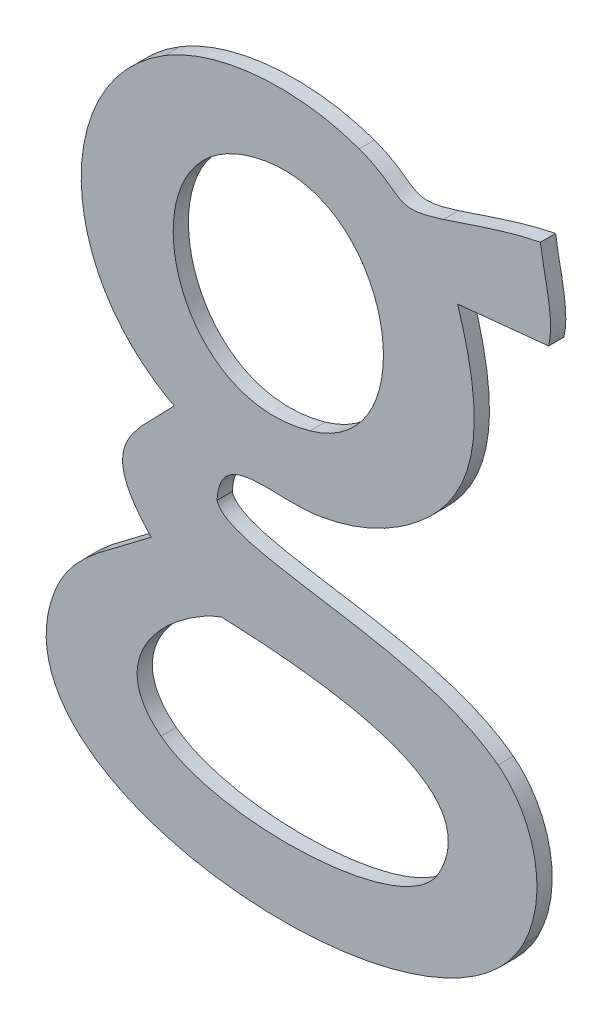
ISO-10303-21;
HEADER;
FILE_DESCRIPTION(('STEP AP214'),'2;1');
FILE_NAME('part.step','',(''),(''),'','','');
FILE_SCHEMA(('AUTOMOTIVE_DESIGN { 1 0 10303 214 1 1 1 1 }'));
ENDSEC;
DATA;
#1=APPLICATION_CONTEXT('core data for automotive mechanical design processes');
#2=APPLICATION_PROTOCOL_DEFINITION('international standard','automotive_design',2000,#1);
#3=PRODUCT_CONTEXT('',#1,'mechanical');
#4=PRODUCT('Part','Part','',(#3));
#5=PRODUCT_RELATED_PRODUCT_CATEGORY('part','',(#4));
#6=PRODUCT_DEFINITION_FORMATION('','',#4);
#7=PRODUCT_DEFINITION_CONTEXT('part definition',#1,'design');
#8=PRODUCT_DEFINITION('design','',#6,#7);
#9=PRODUCT_DEFINITION_SHAPE('','',#8);
#10=(LENGTH_UNIT() NAMED_UNIT(*) SI_UNIT(.MILLI.,.METRE.));
#11=(NAMED_UNIT(*) PLANE_ANGLE_UNIT() SI_UNIT($,.RADIAN.));
#12=(NAMED_UNIT(*) SI_UNIT($,.STERADIAN.) SOLID_ANGLE_UNIT());
#13=UNCERTAINTY_MEASURE_WITH_UNIT(LENGTH_MEASURE(1.E-05),#10,'distance_accuracy_value','');
#14=(GEOMETRIC_REPRESENTATION_CONTEXT(3) GLOBAL_UNCERTAINTY_ASSIGNED_CONTEXT((#13)) GLOBAL_UNIT_ASSIGNED_CONTEXT((#10,
#11,#12)) REPRESENTATION_CONTEXT('',''));
#15=CARTESIAN_POINT('',(0.,0.,0.));
#16=DIRECTION('',(0.,0.,1.));
#17=DIRECTION('',(1.,0.,0.));
#18=AXIS2_PLACEMENT_3D('',#15,#16,#17);
#19=CARTESIAN_POINT('',(-1.859483203125,-48.6271340234375,0.001));
#20=CARTESIAN_POINT('',(-1.859483203125,-48.6271340234375,0.));
#21=CARTESIAN_POINT('',(-1.8568278515625,-48.626718125,0.001));
#22=CARTESIAN_POINT('',(-1.8568278515625,-48.626718125,0.));
#23=CARTESIAN_POINT('',(-1.854620390625,-48.6255344140625,0.001));
#24=CARTESIAN_POINT('',(-1.854620390625,-48.6255344140625,0.));
#25=CARTESIAN_POINT('',(-1.8530527734375,-48.6242547265625,0.001));
#26=CARTESIAN_POINT('',(-1.8530527734375,-48.6242547265625,0.));
#27=B_SPLINE_SURFACE_WITH_KNOTS('',3,1,((#19,#20),(#21,#22),(#23,#24),(#25,#26)),.UNSPECIFIED.,
.F.,.F.,.F.,(4,4),(2,2),(0.75,0.8125),(0.,1.),.UNSPECIFIED.);
#28=CARTESIAN_POINT('',(-1.859483203125,-48.6271340234375,0.));
#29=CARTESIAN_POINT('',(-1.8568278515625,-48.626718125,0.));
#30=CARTESIAN_POINT('',(-1.854620390625,-48.6255344140625,0.));
#31=CARTESIAN_POINT('',(-1.8530527734375,-48.6242547265625,0.));
#32=B_SPLINE_CURVE_WITH_KNOTS('',3,(#28,#29,#30,#31),.UNSPECIFIED.,.F.,.F.,(4,4),(0.75,0.8125),.UNSPECIFIED.);
#33=CARTESIAN_POINT('',(-1.859483203125,-48.6271340234375,0.));
#34=VERTEX_POINT('',#33);
#35=CARTESIAN_POINT('',(-1.8530527734375,-48.6242547265625,0.));
#36=VERTEX_POINT('',#35);
#37=EDGE_CURVE('E11',#34,#36,#32,.T.);
#38=DIRECTION('',(0.,0.,-1.));
#39=VECTOR('',#38,1.);
#40=CARTESIAN_POINT('',(-1.8530527734375,-48.6242547265625,0.001));
#41=LINE('',#40,#39);
#42=CARTESIAN_POINT('',(-1.8530527734375,-48.6242547265625,0.001));
#43=VERTEX_POINT('',#42);
#44=EDGE_CURVE('E28',#43,#36,#41,.T.);
#45=CARTESIAN_POINT('',(-1.859483203125,-48.6271340234375,0.001));
#46=CARTESIAN_POINT('',(-1.8568278515625,-48.626718125,0.001));
#47=CARTESIAN_POINT('',(-1.854620390625,-48.6255344140625,0.001));
#48=CARTESIAN_POINT('',(-1.8530527734375,-48.6242547265625,0.001));
#49=B_SPLINE_CURVE_WITH_KNOTS('',3,(#45,#46,#47,#48),.UNSPECIFIED.,.F.,.F.,(4,4),(0.75,0.8125),.UNSPECIFIED.);
#50=CARTESIAN_POINT('',(-1.859483203125,-48.6271340234375,0.001));
#51=VERTEX_POINT('',#50);
#52=EDGE_CURVE('E464',#51,#43,#49,.T.);
#53=DIRECTION('',(0.,0.,-1.));
#54=VECTOR('',#53,1.);
#55=CARTESIAN_POINT('',(-1.859483203125,-48.6271340234375,0.001));
#56=LINE('',#55,#54);
#57=EDGE_CURVE('E40',#51,#34,#56,.T.);
#58=ORIENTED_EDGE('',*,*,#37,.T.);
#59=ORIENTED_EDGE('',*,*,#44,.F.);
#60=ORIENTED_EDGE('',*,*,#52,.F.);
#61=ORIENTED_EDGE('',*,*,#57,.T.);
#62=EDGE_LOOP('',(#58,#59,#60,#61));
#63=FACE_BOUND('',#62,.T.);
#64=ADVANCED_FACE('F17',(#63),#27,.F.);
#65=CARTESIAN_POINT('',(-1.8530527734375,-48.6242547265625,0.001));
#66=CARTESIAN_POINT('',(-1.8530527734375,-48.6242547265625,0.));
#67=CARTESIAN_POINT('',(-1.84892578125,-48.6209275390625,0.001));
#68=CARTESIAN_POINT('',(-1.84892578125,-48.6209275390625,0.));
#69=CARTESIAN_POINT('',(-1.848477890625,-48.6165126171875,0.001));
#70=CARTESIAN_POINT('',(-1.848477890625,-48.6165126171875,0.));
#71=CARTESIAN_POINT('',(-1.850397421875,-48.610530078125,0.001));
#72=CARTESIAN_POINT('',(-1.850397421875,-48.610530078125,0.));
#73=B_SPLINE_SURFACE_WITH_KNOTS('',3,1,((#65,#66),(#67,#68),(#69,#70),(#71,#72)),.UNSPECIFIED.,
.F.,.F.,.F.,(4,4),(2,2),(0.8125,0.875),(0.,1.),.UNSPECIFIED.);
#74=CARTESIAN_POINT('',(-1.8530527734375,-48.6242547265625,0.));
#75=CARTESIAN_POINT('',(-1.84892578125,-48.6209275390625,0.));
#76=CARTESIAN_POINT('',(-1.848477890625,-48.6165126171875,0.));
#77=CARTESIAN_POINT('',(-1.850397421875,-48.610530078125,0.));
#78=B_SPLINE_CURVE_WITH_KNOTS('',3,(#74,#75,#76,#77),.UNSPECIFIED.,.F.,.F.,(4,4),(0.8125,0.875),.UNSPECIFIED.);
#79=CARTESIAN_POINT('',(-1.850397421875,-48.610530078125,0.));
#80=VERTEX_POINT('',#79);
#81=EDGE_CURVE('E456',#36,#80,#78,.T.);
#82=DIRECTION('',(0.,0.,-1.));
#83=VECTOR('',#82,1.);
#84=CARTESIAN_POINT('',(-1.850397421875,-48.610530078125,0.001));
#85=LINE('',#84,#83);
#86=CARTESIAN_POINT('',(-1.850397421875,-48.610530078125,0.001));
#87=VERTEX_POINT('',#86);
#88=EDGE_CURVE('E451',#87,#80,#85,.T.);
#89=CARTESIAN_POINT('',(-1.8530527734375,-48.6242547265625,0.001));
#90=CARTESIAN_POINT('',(-1.84892578125,-48.6209275390625,0.001));
#91=CARTESIAN_POINT('',(-1.848477890625,-48.6165126171875,0.001));
#92=CARTESIAN_POINT('',(-1.850397421875,-48.610530078125,0.001));
#93=B_SPLINE_CURVE_WITH_KNOTS('',3,(#89,#90,#91,#92),.UNSPECIFIED.,.F.,.F.,(4,4),(0.8125,0.875),.UNSPECIFIED.);
#94=EDGE_CURVE('E447',#43,#87,#93,.T.);
#95=ORIENTED_EDGE('',*,*,#81,.T.);
#96=ORIENTED_EDGE('',*,*,#88,.F.);
#97=ORIENTED_EDGE('',*,*,#94,.F.);
#98=ORIENTED_EDGE('',*,*,#44,.T.);
#99=EDGE_LOOP('',(#95,#96,#97,#98));
#100=FACE_BOUND('',#99,.T.);
#101=ADVANCED_FACE('F475',(#100),#73,.F.);
#102=CARTESIAN_POINT('',(4.8696637390974,-47.9277431152291,0.001));
#103=DIRECTION('',(-0.101083851774875,0.994877909549888,0.));
#104=DIRECTION('',(-0.994877909549888,-0.101083851774875,0.));
#105=AXIS2_PLACEMENT_3D('',#102,#103,#104);
#106=PLANE('',#105);
#107=DIRECTION('',(0.994877909549888,0.101083851774875,0.));
#108=VECTOR('',#107,1.);
#109=CARTESIAN_POINT('',(4.8696637390974,-47.9277431152291,0.));
#110=LINE('',#109,#108);
#111=CARTESIAN_POINT('',(-1.8444148828125,-48.6099222265625,0.));
#112=VERTEX_POINT('',#111);
#113=EDGE_CURVE('E445',#80,#112,#110,.T.);
#114=ORIENTED_EDGE('',*,*,#113,.T.);
#115=DIRECTION('',(0.,0.,-1.));
#116=VECTOR('',#115,1.);
#117=CARTESIAN_POINT('',(-1.8444148828125,-48.6099222265625,0.001));
#118=LINE('',#117,#116);
#119=CARTESIAN_POINT('',(-1.8444148828125,-48.6099222265625,0.001));
#120=VERTEX_POINT('',#119);
#121=EDGE_CURVE('E442',#120,#112,#118,.T.);
#122=ORIENTED_EDGE('',*,*,#121,.F.);
#123=DIRECTION('',(0.994877909549888,0.101083851774875,0.));
#124=VECTOR('',#123,1.);
#125=CARTESIAN_POINT('',(4.8696637390974,-47.9277431152291,0.001));
#126=LINE('',#125,#124);
#127=EDGE_CURVE('E436',#87,#120,#126,.T.);
#128=ORIENTED_EDGE('',*,*,#127,.F.);
#129=ORIENTED_EDGE('',*,*,#88,.T.);
#130=EDGE_LOOP('',(#114,#122,#128,#129));
#131=FACE_BOUND('',#130,.T.);
#132=ADVANCED_FACE('F479',(#131),#106,.F.);
#133=CARTESIAN_POINT('',(-1.8444148828125,-48.6099222265625,0.001));
#134=CARTESIAN_POINT('',(-1.8444148828125,-48.6099222265625,0.));
#135=CARTESIAN_POINT('',(-1.843998984375,-48.6081946484375,0.001));
#136=CARTESIAN_POINT('',(-1.843998984375,-48.6081946484375,0.));
#137=CARTESIAN_POINT('',(-1.8447348046875,-48.6060831640625,0.001));
#138=CARTESIAN_POINT('',(-1.8447348046875,-48.6060831640625,0.));
#139=CARTESIAN_POINT('',(-1.84495875,-48.6042916015625,0.001));
#140=CARTESIAN_POINT('',(-1.84495875,-48.6042916015625,0.));
#141=B_SPLINE_SURFACE_WITH_KNOTS('',3,1,((#133,#134),(#135,#136),(#137,#138),(#139,#140)),
.UNSPECIFIED.,.F.,.F.,.F.,(4,4),(2,2),(0.,0.0625),(0.,1.),.UNSPECIFIED.);
#142=CARTESIAN_POINT('',(-1.8444148828125,-48.6099222265625,0.));
#143=CARTESIAN_POINT('',(-1.843998984375,-48.6081946484375,0.));
#144=CARTESIAN_POINT('',(-1.8447348046875,-48.6060831640625,0.));
#145=CARTESIAN_POINT('',(-1.84495875,-48.6042916015625,0.));
#146=B_SPLINE_CURVE_WITH_KNOTS('',3,(#142,#143,#144,#145),.UNSPECIFIED.,.F.,.F.,(4,4),(0.,
0.0625),.UNSPECIFIED.);
#147=CARTESIAN_POINT('',(-1.84495875,-48.6042916015625,0.));
#148=VERTEX_POINT('',#147);
#149=EDGE_CURVE('E431',#112,#148,#146,.T.);
#150=DIRECTION('',(0.,0.,-1.));
#151=VECTOR('',#150,1.);
#152=CARTESIAN_POINT('',(-1.84495875,-48.6042916015625,0.001));
#153=LINE('',#152,#151);
#154=CARTESIAN_POINT('',(-1.84495875,-48.6042916015625,0.001));
#155=VERTEX_POINT('',#154);
#156=EDGE_CURVE('E426',#155,#148,#153,.T.);
#157=CARTESIAN_POINT('',(-1.8444148828125,-48.6099222265625,0.001));
#158=CARTESIAN_POINT('',(-1.843998984375,-48.6081946484375,0.001));
#159=CARTESIAN_POINT('',(-1.8447348046875,-48.6060831640625,0.001));
#160=CARTESIAN_POINT('',(-1.84495875,-48.6042916015625,0.001));
#161=B_SPLINE_CURVE_WITH_KNOTS('',3,(#157,#158,#159,#160),.UNSPECIFIED.,.F.,.F.,(4,4),(0.,
0.0625),.UNSPECIFIED.);
#162=EDGE_CURVE('E419',#120,#155,#161,.T.);
#163=ORIENTED_EDGE('',*,*,#149,.T.);
#164=ORIENTED_EDGE('',*,*,#156,.F.);
#165=ORIENTED_EDGE('',*,*,#162,.F.);
#166=ORIENTED_EDGE('',*,*,#121,.T.);
#167=EDGE_LOOP('',(#163,#164,#165,#166));
#168=FACE_BOUND('',#167,.T.);
#169=ADVANCED_FACE('F483',(#168),#141,.F.);
#170=CARTESIAN_POINT('',(-1.84495875,-48.6042916015625,0.001));
#171=CARTESIAN_POINT('',(-1.84495875,-48.6042916015625,0.));
#172=CARTESIAN_POINT('',(-1.8469742578125,-48.6046755078125,0.001));
#173=CARTESIAN_POINT('',(-1.8469742578125,-48.6046755078125,0.));
#174=CARTESIAN_POINT('',(-1.849373671875,-48.605539296875,0.001));
#175=CARTESIAN_POINT('',(-1.849373671875,-48.605539296875,0.));
#176=CARTESIAN_POINT('',(-1.8513251953125,-48.606179140625,0.001));
#177=CARTESIAN_POINT('',(-1.8513251953125,-48.606179140625,0.));
#178=B_SPLINE_SURFACE_WITH_KNOTS('',3,1,((#170,#171),(#172,#173),(#174,#175),(#176,#177)),
.UNSPECIFIED.,.F.,.F.,.F.,(4,4),(2,2),(0.0625,0.125),(0.,1.),.UNSPECIFIED.);
#179=CARTESIAN_POINT('',(-1.84495875,-48.6042916015625,0.));
#180=CARTESIAN_POINT('',(-1.8469742578125,-48.6046755078125,0.));
#181=CARTESIAN_POINT('',(-1.849373671875,-48.605539296875,0.));
#182=CARTESIAN_POINT('',(-1.8513251953125,-48.606179140625,0.));
#183=B_SPLINE_CURVE_WITH_KNOTS('',3,(#179,#180,#181,#182),.UNSPECIFIED.,.F.,.F.,(4,4),(0.0625,
0.125),.UNSPECIFIED.);
#184=CARTESIAN_POINT('',(-1.8513251953125,-48.606179140625,0.));
#185=VERTEX_POINT('',#184);
#186=EDGE_CURVE('E414',#148,#185,#183,.T.);
#187=DIRECTION('',(0.,0.,-1.));
#188=VECTOR('',#187,1.);
#189=CARTESIAN_POINT('',(-1.8513251953125,-48.606179140625,0.001));
#190=LINE('',#189,#188);
#191=CARTESIAN_POINT('',(-1.8513251953125,-48.606179140625,0.001));
#192=VERTEX_POINT('',#191);
#193=EDGE_CURVE('E409',#192,#185,#190,.T.);
#194=CARTESIAN_POINT('',(-1.84495875,-48.6042916015625,0.001));
#195=CARTESIAN_POINT('',(-1.8469742578125,-48.6046755078125,0.001));
#196=CARTESIAN_POINT('',(-1.849373671875,-48.605539296875,0.001));
#197=CARTESIAN_POINT('',(-1.8513251953125,-48.606179140625,0.001));
#198=B_SPLINE_CURVE_WITH_KNOTS('',3,(#194,#195,#196,#197),.UNSPECIFIED.,.F.,.F.,(4,4),(0.0625,
0.125),.UNSPECIFIED.);
#199=EDGE_CURVE('E402',#155,#192,#198,.T.);
#200=ORIENTED_EDGE('',*,*,#186,.T.);
#201=ORIENTED_EDGE('',*,*,#193,.F.);
#202=ORIENTED_EDGE('',*,*,#199,.F.);
#203=ORIENTED_EDGE('',*,*,#156,.T.);
#204=EDGE_LOOP('',(#200,#201,#202,#203));
#205=FACE_BOUND('',#204,.T.);
#206=ADVANCED_FACE('F489',(#205),#178,.F.);
#207=CARTESIAN_POINT('',(-1.8513251953125,-48.606179140625,0.001));
#208=CARTESIAN_POINT('',(-1.8513251953125,-48.606179140625,0.));
#209=CARTESIAN_POINT('',(-1.85481234375,-48.607330859375,0.001));
#210=CARTESIAN_POINT('',(-1.85481234375,-48.607330859375,0.));
#211=CARTESIAN_POINT('',(-1.8538205859375,-48.606051171875,0.001));
#212=CARTESIAN_POINT('',(-1.8538205859375,-48.606051171875,0.));
#213=CARTESIAN_POINT('',(-1.85685984375,-48.6049314453125,0.001));
#214=CARTESIAN_POINT('',(-1.85685984375,-48.6049314453125,0.));
#215=B_SPLINE_SURFACE_WITH_KNOTS('',3,1,((#207,#208),(#209,#210),(#211,#212),(#213,#214)),
.UNSPECIFIED.,.F.,.F.,.F.,(4,4),(2,2),(0.125,0.1875),(0.,1.),.UNSPECIFIED.);
#216=CARTESIAN_POINT('',(-1.8513251953125,-48.606179140625,0.));
#217=CARTESIAN_POINT('',(-1.85481234375,-48.607330859375,0.));
#218=CARTESIAN_POINT('',(-1.8538205859375,-48.606051171875,0.));
#219=CARTESIAN_POINT('',(-1.85685984375,-48.6049314453125,0.));
#220=B_SPLINE_CURVE_WITH_KNOTS('',3,(#216,#217,#218,#219),.UNSPECIFIED.,.F.,.F.,(4,4),(0.125,
0.1875),.UNSPECIFIED.);
#221=CARTESIAN_POINT('',(-1.85685984375,-48.6049314453125,0.));
#222=VERTEX_POINT('',#221);
#223=EDGE_CURVE('E397',#185,#222,#220,.T.);
#224=DIRECTION('',(0.,0.,-1.));
#225=VECTOR('',#224,1.);
#226=CARTESIAN_POINT('',(-1.85685984375,-48.6049314453125,0.001));
#227=LINE('',#226,#225);
#228=CARTESIAN_POINT('',(-1.85685984375,-48.6049314453125,0.001));
#229=VERTEX_POINT('',#228);
#230=EDGE_CURVE('E392',#229,#222,#227,.T.);
#231=CARTESIAN_POINT('',(-1.8513251953125,-48.606179140625,0.001));
#232=CARTESIAN_POINT('',(-1.85481234375,-48.607330859375,0.001));
#233=CARTESIAN_POINT('',(-1.8538205859375,-48.606051171875,0.001));
#234=CARTESIAN_POINT('',(-1.85685984375,-48.6049314453125,0.001));
#235=B_SPLINE_CURVE_WITH_KNOTS('',3,(#231,#232,#233,#234),.UNSPECIFIED.,.F.,.F.,(4,4),(0.125,
0.1875),.UNSPECIFIED.);
#236=EDGE_CURVE('E385',#192,#229,#235,.T.);
#237=ORIENTED_EDGE('',*,*,#223,.T.);
#238=ORIENTED_EDGE('',*,*,#230,.F.);
#239=ORIENTED_EDGE('',*,*,#236,.F.);
#240=ORIENTED_EDGE('',*,*,#193,.T.);
#241=EDGE_LOOP('',(#237,#238,#239,#240));
#242=FACE_BOUND('',#241,.T.);
#243=ADVANCED_FACE('F495',(#242),#215,.F.);
#244=CARTESIAN_POINT('',(-1.85685984375,-48.6049314453125,0.001));
#245=CARTESIAN_POINT('',(-1.85685984375,-48.6049314453125,0.));
#246=CARTESIAN_POINT('',(-1.8610508203125,-48.6034278125,0.001));
#247=CARTESIAN_POINT('',(-1.8610508203125,-48.6034278125,0.));
#248=CARTESIAN_POINT('',(-1.8662015625,-48.6039076953125,0.001));
#249=CARTESIAN_POINT('',(-1.8662015625,-48.6039076953125,0.));
#250=CARTESIAN_POINT('',(-1.86965671875,-48.6060191796875,0.001));
#251=CARTESIAN_POINT('',(-1.86965671875,-48.6060191796875,0.));
#252=B_SPLINE_SURFACE_WITH_KNOTS('',3,1,((#244,#245),(#246,#247),(#248,#249),(#250,#251)),
.UNSPECIFIED.,.F.,.F.,.F.,(4,4),(2,2),(0.1875,0.25),(0.,1.),.UNSPECIFIED.);
#253=CARTESIAN_POINT('',(-1.85685984375,-48.6049314453125,0.));
#254=CARTESIAN_POINT('',(-1.8610508203125,-48.6034278125,0.));
#255=CARTESIAN_POINT('',(-1.8662015625,-48.6039076953125,0.));
#256=CARTESIAN_POINT('',(-1.86965671875,-48.6060191796875,0.));
#257=B_SPLINE_CURVE_WITH_KNOTS('',3,(#253,#254,#255,#256),.UNSPECIFIED.,.F.,.F.,(4,4),(0.1875,
0.25),.UNSPECIFIED.);
#258=CARTESIAN_POINT('',(-1.86965671875,-48.6060191796875,0.));
#259=VERTEX_POINT('',#258);
#260=EDGE_CURVE('E380',#222,#259,#257,.T.);
#261=DIRECTION('',(0.,0.,-1.));
#262=VECTOR('',#261,1.);
#263=CARTESIAN_POINT('',(-1.86965671875,-48.6060191796875,0.001));
#264=LINE('',#263,#262);
#265=CARTESIAN_POINT('',(-1.86965671875,-48.6060191796875,0.001));
#266=VERTEX_POINT('',#265);
#267=EDGE_CURVE('E375',#266,#259,#264,.T.);
#268=CARTESIAN_POINT('',(-1.85685984375,-48.6049314453125,0.001));
#269=CARTESIAN_POINT('',(-1.8610508203125,-48.6034278125,0.001));
#270=CARTESIAN_POINT('',(-1.8662015625,-48.6039076953125,0.001));
#271=CARTESIAN_POINT('',(-1.86965671875,-48.6060191796875,0.001));
#272=B_SPLINE_CURVE_WITH_KNOTS('',3,(#268,#269,#270,#271),.UNSPECIFIED.,.F.,.F.,(4,4),(0.1875,
0.25),.UNSPECIFIED.);
#273=EDGE_CURVE('E368',#229,#266,#272,.T.);
#274=ORIENTED_EDGE('',*,*,#260,.T.);
#275=ORIENTED_EDGE('',*,*,#267,.F.);
#276=ORIENTED_EDGE('',*,*,#273,.F.);
#277=ORIENTED_EDGE('',*,*,#230,.T.);
#278=EDGE_LOOP('',(#274,#275,#276,#277));
#279=FACE_BOUND('',#278,.T.);
#280=ADVANCED_FACE('F499',(#279),#252,.F.);
#281=CARTESIAN_POINT('',(-1.86965671875,-48.6060191796875,0.001));
#282=CARTESIAN_POINT('',(-1.86965671875,-48.6060191796875,0.));
#283=CARTESIAN_POINT('',(-1.877142890625,-48.6105940625,0.001));
#284=CARTESIAN_POINT('',(-1.877142890625,-48.6105940625,0.));
#285=CARTESIAN_POINT('',(-1.8769509375,-48.62147140625,0.001));
#286=CARTESIAN_POINT('',(-1.8769509375,-48.62147140625,0.));
#287=CARTESIAN_POINT('',(-1.869016875,-48.625630390625,0.001));
#288=CARTESIAN_POINT('',(-1.869016875,-48.625630390625,0.));
#289=B_SPLINE_SURFACE_WITH_KNOTS('',3,1,((#281,#282),(#283,#284),(#285,#286),(#287,#288)),
.UNSPECIFIED.,.F.,.F.,.F.,(4,4),(2,2),(0.25,0.3125),(0.,1.),.UNSPECIFIED.);
#290=CARTESIAN_POINT('',(-1.86965671875,-48.6060191796875,0.));
#291=CARTESIAN_POINT('',(-1.877142890625,-48.6105940625,0.));
#292=CARTESIAN_POINT('',(-1.8769509375,-48.62147140625,0.));
#293=CARTESIAN_POINT('',(-1.869016875,-48.625630390625,0.));
#294=B_SPLINE_CURVE_WITH_KNOTS('',3,(#290,#291,#292,#293),.UNSPECIFIED.,.F.,.F.,(4,4),(0.25,
0.3125),.UNSPECIFIED.);
#295=CARTESIAN_POINT('',(-1.869016875,-48.625630390625,0.));
#296=VERTEX_POINT('',#295);
#297=EDGE_CURVE('E363',#259,#296,#294,.T.);
#298=DIRECTION('',(0.,0.,-1.));
#299=VECTOR('',#298,1.);
#300=CARTESIAN_POINT('',(-1.869016875,-48.625630390625,0.001));
#301=LINE('',#300,#299);
#302=CARTESIAN_POINT('',(-1.869016875,-48.625630390625,0.001));
#303=VERTEX_POINT('',#302);
#304=EDGE_CURVE('E358',#303,#296,#301,.T.);
#305=CARTESIAN_POINT('',(-1.86965671875,-48.6060191796875,0.001));
#306=CARTESIAN_POINT('',(-1.877142890625,-48.6105940625,0.001));
#307=CARTESIAN_POINT('',(-1.8769509375,-48.62147140625,0.001));
#308=CARTESIAN_POINT('',(-1.869016875,-48.625630390625,0.001));
#309=B_SPLINE_CURVE_WITH_KNOTS('',3,(#305,#306,#307,#308),.UNSPECIFIED.,.F.,.F.,(4,4),(0.25,
0.3125),.UNSPECIFIED.);
#310=EDGE_CURVE('E351',#266,#303,#309,.T.);
#311=ORIENTED_EDGE('',*,*,#297,.T.);
#312=ORIENTED_EDGE('',*,*,#304,.F.);
#313=ORIENTED_EDGE('',*,*,#310,.F.);
#314=ORIENTED_EDGE('',*,*,#267,.T.);
#315=EDGE_LOOP('',(#311,#312,#313,#314));
#316=FACE_BOUND('',#315,.T.);
#317=ADVANCED_FACE('F504',(#316),#289,.F.);
#318=CARTESIAN_POINT('',(-1.869016875,-48.625630390625,0.001));
#319=CARTESIAN_POINT('',(-1.869016875,-48.625630390625,0.));
#320=CARTESIAN_POINT('',(-1.8715442578125,-48.62838171875,0.001));
#321=CARTESIAN_POINT('',(-1.8715442578125,-48.62838171875,0.));
#322=CARTESIAN_POINT('',(-1.8743595703125,-48.6298853515625,0.001));
#323=CARTESIAN_POINT('',(-1.8743595703125,-48.6298853515625,0.));
#324=CARTESIAN_POINT('',(-1.8705205078125,-48.6338523828125,0.001));
#325=CARTESIAN_POINT('',(-1.8705205078125,-48.6338523828125,0.));
#326=B_SPLINE_SURFACE_WITH_KNOTS('',3,1,((#318,#319),(#320,#321),(#322,#323),(#324,#325)),
.UNSPECIFIED.,.F.,.F.,.F.,(4,4),(2,2),(0.3125,0.375),(0.,1.),.UNSPECIFIED.);
#327=CARTESIAN_POINT('',(-1.869016875,-48.625630390625,0.));
#328=CARTESIAN_POINT('',(-1.8715442578125,-48.62838171875,0.));
#329=CARTESIAN_POINT('',(-1.8743595703125,-48.6298853515625,0.));
#330=CARTESIAN_POINT('',(-1.8705205078125,-48.6338523828125,0.));
#331=B_SPLINE_CURVE_WITH_KNOTS('',3,(#327,#328,#329,#330),.UNSPECIFIED.,.F.,.F.,(4,4),(0.3125,
0.375),.UNSPECIFIED.);
#332=CARTESIAN_POINT('',(-1.8705205078125,-48.6338523828125,0.));
#333=VERTEX_POINT('',#332);
#334=EDGE_CURVE('E346',#296,#333,#331,.T.);
#335=DIRECTION('',(0.,0.,-1.));
#336=VECTOR('',#335,1.);
#337=CARTESIAN_POINT('',(-1.8705205078125,-48.6338523828125,0.001));
#338=LINE('',#337,#336);
#339=CARTESIAN_POINT('',(-1.8705205078125,-48.6338523828125,0.001));
#340=VERTEX_POINT('',#339);
#341=EDGE_CURVE('E341',#340,#333,#338,.T.);
#342=CARTESIAN_POINT('',(-1.869016875,-48.625630390625,0.001));
#343=CARTESIAN_POINT('',(-1.8715442578125,-48.62838171875,0.001));
#344=CARTESIAN_POINT('',(-1.8743595703125,-48.6298853515625,0.001));
#345=CARTESIAN_POINT('',(-1.8705205078125,-48.6338523828125,0.001));
#346=B_SPLINE_CURVE_WITH_KNOTS('',3,(#342,#343,#344,#345),.UNSPECIFIED.,.F.,.F.,(4,4),(0.3125,
0.375),.UNSPECIFIED.);
#347=EDGE_CURVE('E337',#303,#340,#346,.T.);
#348=ORIENTED_EDGE('',*,*,#334,.T.);
#349=ORIENTED_EDGE('',*,*,#341,.F.);
#350=ORIENTED_EDGE('',*,*,#347,.F.);
#351=ORIENTED_EDGE('',*,*,#304,.T.);
#352=EDGE_LOOP('',(#348,#349,#350,#351));
#353=FACE_BOUND('',#352,.T.);
#354=ADVANCED_FACE('F510',(#353),#326,.F.);
#355=CARTESIAN_POINT('',(22.720939614713,-30.0240987765638,0.001));
#356=DIRECTION('',(0.603442670185808,-0.797406385602111,0.));
#357=DIRECTION('',(0.797406385602111,0.603442670185808,0.));
#358=AXIS2_PLACEMENT_3D('',#355,#356,#357);
#359=PLANE('',#358);
#360=DIRECTION('',(-0.797406385602111,-0.603442670185808,0.));
#361=VECTOR('',#360,1.);
#362=CARTESIAN_POINT('',(22.720939614713,-30.0240987765638,0.));
#363=LINE('',#362,#361);
#364=CARTESIAN_POINT('',(-1.874071640625,-48.6365397265625,0.));
#365=VERTEX_POINT('',#364);
#366=EDGE_CURVE('E335',#333,#365,#363,.T.);
#367=ORIENTED_EDGE('',*,*,#366,.T.);
#368=DIRECTION('',(0.,0.,-1.));
#369=VECTOR('',#368,1.);
#370=CARTESIAN_POINT('',(-1.874071640625,-48.6365397265625,0.001));
#371=LINE('',#370,#369);
#372=CARTESIAN_POINT('',(-1.874071640625,-48.6365397265625,0.001));
#373=VERTEX_POINT('',#372);
#374=EDGE_CURVE('E332',#373,#365,#371,.T.);
#375=ORIENTED_EDGE('',*,*,#374,.F.);
#376=DIRECTION('',(-0.797406385602111,-0.603442670185808,0.));
#377=VECTOR('',#376,1.);
#378=CARTESIAN_POINT('',(22.720939614713,-30.0240987765638,0.001));
#379=LINE('',#378,#377);
#380=EDGE_CURVE('E326',#340,#373,#379,.T.);
#381=ORIENTED_EDGE('',*,*,#380,.F.);
#382=ORIENTED_EDGE('',*,*,#341,.T.);
#383=EDGE_LOOP('',(#367,#375,#381,#382));
#384=FACE_BOUND('',#383,.T.);
#385=ADVANCED_FACE('F514',(#384),#359,.F.);
#386=CARTESIAN_POINT('',(-1.874071640625,-48.6365397265625,0.001));
#387=CARTESIAN_POINT('',(-1.874071640625,-48.6365397265625,0.));
#388=CARTESIAN_POINT('',(-1.8750633984375,-48.63733953125,0.001));
#389=CARTESIAN_POINT('',(-1.8750633984375,-48.63733953125,0.));
#390=CARTESIAN_POINT('',(-1.8762151171875,-48.6384592578125,0.001));
#391=CARTESIAN_POINT('',(-1.8762151171875,-48.6384592578125,0.));
#392=CARTESIAN_POINT('',(-1.87682296875,-48.6399948828125,0.001));
#393=CARTESIAN_POINT('',(-1.87682296875,-48.6399948828125,0.));
#394=B_SPLINE_SURFACE_WITH_KNOTS('',3,1,((#386,#387),(#388,#389),(#390,#391),(#392,#393)),
.UNSPECIFIED.,.F.,.F.,.F.,(4,4),(2,2),(0.4375,0.5),(0.,1.),.UNSPECIFIED.);
#395=CARTESIAN_POINT('',(-1.874071640625,-48.6365397265625,0.));
#396=CARTESIAN_POINT('',(-1.8750633984375,-48.63733953125,0.));
#397=CARTESIAN_POINT('',(-1.8762151171875,-48.6384592578125,0.));
#398=CARTESIAN_POINT('',(-1.87682296875,-48.6399948828125,0.));
#399=B_SPLINE_CURVE_WITH_KNOTS('',3,(#395,#396,#397,#398),.UNSPECIFIED.,.F.,.F.,(4,4),(0.4375,
0.5),.UNSPECIFIED.);
#400=CARTESIAN_POINT('',(-1.87682296875,-48.6399948828125,0.));
#401=VERTEX_POINT('',#400);
#402=EDGE_CURVE('E321',#365,#401,#399,.T.);
#403=DIRECTION('',(0.,0.,-1.));
#404=VECTOR('',#403,1.);
#405=CARTESIAN_POINT('',(-1.87682296875,-48.6399948828125,0.001));
#406=LINE('',#405,#404);
#407=CARTESIAN_POINT('',(-1.87682296875,-48.6399948828125,0.001));
#408=VERTEX_POINT('',#407);
#409=EDGE_CURVE('E316',#408,#401,#406,.T.);
#410=CARTESIAN_POINT('',(-1.874071640625,-48.6365397265625,0.001));
#411=CARTESIAN_POINT('',(-1.8750633984375,-48.63733953125,0.001));
#412=CARTESIAN_POINT('',(-1.8762151171875,-48.6384592578125,0.001));
#413=CARTESIAN_POINT('',(-1.87682296875,-48.6399948828125,0.001));
#414=B_SPLINE_CURVE_WITH_KNOTS('',3,(#410,#411,#412,#413),.UNSPECIFIED.,.F.,.F.,(4,4),(0.4375,
0.5),.UNSPECIFIED.);
#415=EDGE_CURVE('E309',#373,#408,#414,.T.);
#416=ORIENTED_EDGE('',*,*,#402,.T.);
#417=ORIENTED_EDGE('',*,*,#409,.F.);
#418=ORIENTED_EDGE('',*,*,#415,.F.);
#419=ORIENTED_EDGE('',*,*,#374,.T.);
#420=EDGE_LOOP('',(#416,#417,#418,#419));
#421=FACE_BOUND('',#420,.T.);
#422=ADVANCED_FACE('F517',(#421),#394,.F.);
#423=CARTESIAN_POINT('',(-1.87682296875,-48.6399948828125,0.001));
#424=CARTESIAN_POINT('',(-1.87682296875,-48.6399948828125,0.));
#425=CARTESIAN_POINT('',(-1.8820696875,-48.65295171875,0.001));
#426=CARTESIAN_POINT('',(-1.8820696875,-48.65295171875,0.));
#427=CARTESIAN_POINT('',(-1.8514531640625,-48.6552231640625,0.001));
#428=CARTESIAN_POINT('',(-1.8514531640625,-48.6552231640625,0.));
#429=CARTESIAN_POINT('',(-1.84611046875,-48.644825703125,0.001));
#430=CARTESIAN_POINT('',(-1.84611046875,-48.644825703125,0.));
#431=B_SPLINE_SURFACE_WITH_KNOTS('',3,1,((#423,#424),(#425,#426),(#427,#428),(#429,#430)),
.UNSPECIFIED.,.F.,.F.,.F.,(4,4),(2,2),(0.5,0.5625),(0.,1.),.UNSPECIFIED.);
#432=CARTESIAN_POINT('',(-1.87682296875,-48.6399948828125,0.));
#433=CARTESIAN_POINT('',(-1.8820696875,-48.65295171875,0.));
#434=CARTESIAN_POINT('',(-1.8514531640625,-48.6552231640625,0.));
#435=CARTESIAN_POINT('',(-1.84611046875,-48.644825703125,0.));
#436=B_SPLINE_CURVE_WITH_KNOTS('',3,(#432,#433,#434,#435),.UNSPECIFIED.,.F.,.F.,(4,4),(0.5,
0.5625),.UNSPECIFIED.);
#437=CARTESIAN_POINT('',(-1.84611046875,-48.644825703125,0.));
#438=VERTEX_POINT('',#437);
#439=EDGE_CURVE('E304',#401,#438,#436,.T.);
#440=DIRECTION('',(0.,0.,-1.));
#441=VECTOR('',#440,1.);
#442=CARTESIAN_POINT('',(-1.84611046875,-48.644825703125,0.001));
#443=LINE('',#442,#441);
#444=CARTESIAN_POINT('',(-1.84611046875,-48.644825703125,0.001));
#445=VERTEX_POINT('',#444);
#446=EDGE_CURVE('E299',#445,#438,#443,.T.);
#447=CARTESIAN_POINT('',(-1.87682296875,-48.6399948828125,0.001));
#448=CARTESIAN_POINT('',(-1.8820696875,-48.65295171875,0.001));
#449=CARTESIAN_POINT('',(-1.8514531640625,-48.6552231640625,0.001));
#450=CARTESIAN_POINT('',(-1.84611046875,-48.644825703125,0.001));
#451=B_SPLINE_CURVE_WITH_KNOTS('',3,(#447,#448,#449,#450),.UNSPECIFIED.,.F.,.F.,(4,4),(0.5,
0.5625),.UNSPECIFIED.);
#452=EDGE_CURVE('E292',#408,#445,#451,.T.);
#453=ORIENTED_EDGE('',*,*,#439,.T.);
#454=ORIENTED_EDGE('',*,*,#446,.F.);
#455=ORIENTED_EDGE('',*,*,#452,.F.);
#456=ORIENTED_EDGE('',*,*,#409,.T.);
#457=EDGE_LOOP('',(#453,#454,#455,#456));
#458=FACE_BOUND('',#457,.T.);
#459=ADVANCED_FACE('F526',(#458),#431,.F.);
#460=CARTESIAN_POINT('',(-1.84611046875,-48.644825703125,0.001));
#461=CARTESIAN_POINT('',(-1.84611046875,-48.644825703125,0.));
#462=CARTESIAN_POINT('',(-1.844254921875,-48.641242578125,0.001));
#463=CARTESIAN_POINT('',(-1.844254921875,-48.641242578125,0.));
#464=CARTESIAN_POINT('',(-1.8453746484375,-48.6372435546875,0.001));
#465=CARTESIAN_POINT('',(-1.8453746484375,-48.6372435546875,0.));
#466=CARTESIAN_POINT('',(-1.8477420703125,-48.63542,0.001));
#467=CARTESIAN_POINT('',(-1.8477420703125,-48.63542,0.));
#468=B_SPLINE_SURFACE_WITH_KNOTS('',3,1,((#460,#461),(#462,#463),(#464,#465),(#466,#467)),
.UNSPECIFIED.,.F.,.F.,.F.,(4,4),(2,2),(0.5625,0.625),(0.,1.),.UNSPECIFIED.);
#469=CARTESIAN_POINT('',(-1.84611046875,-48.644825703125,0.));
#470=CARTESIAN_POINT('',(-1.844254921875,-48.641242578125,0.));
#471=CARTESIAN_POINT('',(-1.8453746484375,-48.6372435546875,0.));
#472=CARTESIAN_POINT('',(-1.8477420703125,-48.63542,0.));
#473=B_SPLINE_CURVE_WITH_KNOTS('',3,(#469,#470,#471,#472),.UNSPECIFIED.,.F.,.F.,(4,4),(0.5625,
0.625),.UNSPECIFIED.);
#474=CARTESIAN_POINT('',(-1.8477420703125,-48.63542,0.));
#475=VERTEX_POINT('',#474);
#476=EDGE_CURVE('E287',#438,#475,#473,.T.);
#477=DIRECTION('',(0.,0.,-1.));
#478=VECTOR('',#477,1.);
#479=CARTESIAN_POINT('',(-1.8477420703125,-48.63542,0.001));
#480=LINE('',#479,#478);
#481=CARTESIAN_POINT('',(-1.8477420703125,-48.63542,0.001));
#482=VERTEX_POINT('',#481);
#483=EDGE_CURVE('E282',#482,#475,#480,.T.);
#484=CARTESIAN_POINT('',(-1.84611046875,-48.644825703125,0.001));
#485=CARTESIAN_POINT('',(-1.844254921875,-48.641242578125,0.001));
#486=CARTESIAN_POINT('',(-1.8453746484375,-48.6372435546875,0.001));
#487=CARTESIAN_POINT('',(-1.8477420703125,-48.63542,0.001));
#488=B_SPLINE_CURVE_WITH_KNOTS('',3,(#484,#485,#486,#487),.UNSPECIFIED.,.F.,.F.,(4,4),(0.5625,
0.625),.UNSPECIFIED.);
#489=EDGE_CURVE('E275',#445,#482,#488,.T.);
#490=ORIENTED_EDGE('',*,*,#476,.T.);
#491=ORIENTED_EDGE('',*,*,#483,.F.);
#492=ORIENTED_EDGE('',*,*,#489,.F.);
#493=ORIENTED_EDGE('',*,*,#446,.T.);
#494=EDGE_LOOP('',(#490,#491,#492,#493));
#495=FACE_BOUND('',#494,.T.);
#496=ADVANCED_FACE('F533',(#495),#468,.F.);
#497=CARTESIAN_POINT('',(-1.8477420703125,-48.63542,0.001));
#498=CARTESIAN_POINT('',(-1.8477420703125,-48.63542,0.));
#499=CARTESIAN_POINT('',(-1.8531167578125,-48.6312930078125,0.001));
#500=CARTESIAN_POINT('',(-1.8531167578125,-48.6312930078125,0.));
#501=CARTESIAN_POINT('',(-1.8654017578125,-48.6321248046875,0.001));
#502=CARTESIAN_POINT('',(-1.8654017578125,-48.6321248046875,0.));
#503=CARTESIAN_POINT('',(-1.8662015625,-48.629597421875,0.001));
#504=CARTESIAN_POINT('',(-1.8662015625,-48.629597421875,0.));
#505=B_SPLINE_SURFACE_WITH_KNOTS('',3,1,((#497,#498),(#499,#500),(#501,#502),(#503,#504)),
.UNSPECIFIED.,.F.,.F.,.F.,(4,4),(2,2),(0.625,0.6875),(0.,1.),.UNSPECIFIED.);
#506=CARTESIAN_POINT('',(-1.8477420703125,-48.63542,0.));
#507=CARTESIAN_POINT('',(-1.8531167578125,-48.6312930078125,0.));
#508=CARTESIAN_POINT('',(-1.8654017578125,-48.6321248046875,0.));
#509=CARTESIAN_POINT('',(-1.8662015625,-48.629597421875,0.));
#510=B_SPLINE_CURVE_WITH_KNOTS('',3,(#506,#507,#508,#509),.UNSPECIFIED.,.F.,.F.,(4,4),(0.625,
0.6875),.UNSPECIFIED.);
#511=CARTESIAN_POINT('',(-1.8662015625,-48.629597421875,0.));
#512=VERTEX_POINT('',#511);
#513=EDGE_CURVE('E270',#475,#512,#510,.T.);
#514=DIRECTION('',(0.,0.,-1.));
#515=VECTOR('',#514,1.);
#516=CARTESIAN_POINT('',(-1.8662015625,-48.629597421875,0.001));
#517=LINE('',#516,#515);
#518=CARTESIAN_POINT('',(-1.8662015625,-48.629597421875,0.001));
#519=VERTEX_POINT('',#518);
#520=EDGE_CURVE('E265',#519,#512,#517,.T.);
#521=CARTESIAN_POINT('',(-1.8477420703125,-48.63542,0.001));
#522=CARTESIAN_POINT('',(-1.8531167578125,-48.6312930078125,0.001));
#523=CARTESIAN_POINT('',(-1.8654017578125,-48.6321248046875,0.001));
#524=CARTESIAN_POINT('',(-1.8662015625,-48.629597421875,0.001));
#525=B_SPLINE_CURVE_WITH_KNOTS('',3,(#521,#522,#523,#524),.UNSPECIFIED.,.F.,.F.,(4,4),(0.625,
0.6875),.UNSPECIFIED.);
#526=EDGE_CURVE('E258',#482,#519,#525,.T.);
#527=ORIENTED_EDGE('',*,*,#513,.T.);
#528=ORIENTED_EDGE('',*,*,#520,.F.);
#529=ORIENTED_EDGE('',*,*,#526,.F.);
#530=ORIENTED_EDGE('',*,*,#483,.T.);
#531=EDGE_LOOP('',(#527,#528,#529,#530));
#532=FACE_BOUND('',#531,.T.);
#533=ADVANCED_FACE('F535',(#532),#505,.F.);
#534=CARTESIAN_POINT('',(-1.8516451171875,-48.643546015625,0.001));
#535=CARTESIAN_POINT('',(-1.8516451171875,-48.643546015625,0.));
#536=CARTESIAN_POINT('',(-1.8537566015625,-48.6474170703125,0.001));
#537=CARTESIAN_POINT('',(-1.8537566015625,-48.6474170703125,0.));
#538=CARTESIAN_POINT('',(-1.8660416015625,-48.64783296875,0.001));
#539=CARTESIAN_POINT('',(-1.8660416015625,-48.64783296875,0.));
#540=CARTESIAN_POINT('',(-1.8698806640625,-48.6448576953125,0.001));
#541=CARTESIAN_POINT('',(-1.8698806640625,-48.6448576953125,0.));
#542=B_SPLINE_SURFACE_WITH_KNOTS('',3,1,((#534,#535),(#536,#537),(#538,#539),(#540,#541)),
.UNSPECIFIED.,.F.,.F.,.F.,(4,4),(2,2),(0.25,0.5),(0.,1.),.UNSPECIFIED.);
#543=CARTESIAN_POINT('',(-1.8516451171875,-48.643546015625,0.));
#544=CARTESIAN_POINT('',(-1.8537566015625,-48.6474170703125,0.));
#545=CARTESIAN_POINT('',(-1.8660416015625,-48.64783296875,0.));
#546=CARTESIAN_POINT('',(-1.8698806640625,-48.6448576953125,0.));
#547=B_SPLINE_CURVE_WITH_KNOTS('',3,(#543,#544,#545,#546),.UNSPECIFIED.,.F.,.F.,(4,4),(0.25,
0.5),.UNSPECIFIED.);
#548=CARTESIAN_POINT('',(-1.8516451171875,-48.643546015625,0.));
#549=VERTEX_POINT('',#548);
#550=CARTESIAN_POINT('',(-1.8698806640625,-48.6448576953125,0.));
#551=VERTEX_POINT('',#550);
#552=EDGE_CURVE('E253',#549,#551,#547,.T.);
#553=DIRECTION('',(0.,0.,-1.));
#554=VECTOR('',#553,1.);
#555=CARTESIAN_POINT('',(-1.8698806640625,-48.6448576953125,0.001));
#556=LINE('',#555,#554);
#557=CARTESIAN_POINT('',(-1.8698806640625,-48.6448576953125,0.001));
#558=VERTEX_POINT('',#557);
#559=EDGE_CURVE('E248',#558,#551,#556,.T.);
#560=CARTESIAN_POINT('',(-1.8516451171875,-48.643546015625,0.001));
#561=CARTESIAN_POINT('',(-1.8537566015625,-48.6474170703125,0.001));
#562=CARTESIAN_POINT('',(-1.8660416015625,-48.64783296875,0.001));
#563=CARTESIAN_POINT('',(-1.8698806640625,-48.6448576953125,0.001));
#564=B_SPLINE_CURVE_WITH_KNOTS('',3,(#560,#561,#562,#563),.UNSPECIFIED.,.F.,.F.,(4,4),(0.25,
0.5),.UNSPECIFIED.);
#565=CARTESIAN_POINT('',(-1.8516451171875,-48.643546015625,0.001));
#566=VERTEX_POINT('',#565);
#567=EDGE_CURVE('E244',#566,#558,#564,.T.);
#568=DIRECTION('',(0.,0.,-1.));
#569=VECTOR('',#568,1.);
#570=CARTESIAN_POINT('',(-1.8516451171875,-48.643546015625,0.001));
#571=LINE('',#570,#569);
#572=EDGE_CURVE('E239',#566,#549,#571,.T.);
#573=ORIENTED_EDGE('',*,*,#552,.T.);
#574=ORIENTED_EDGE('',*,*,#559,.F.);
#575=ORIENTED_EDGE('',*,*,#567,.F.);
#576=ORIENTED_EDGE('',*,*,#572,.T.);
#577=EDGE_LOOP('',(#573,#574,#575,#576));
#578=FACE_BOUND('',#577,.T.);
#579=ADVANCED_FACE('F659',(#578),#542,.F.);
#580=CARTESIAN_POINT('',(-1.8698806640625,-48.6448576953125,0.001));
#581=CARTESIAN_POINT('',(-1.8698806640625,-48.6448576953125,0.));
#582=CARTESIAN_POINT('',(-1.8740396484375,-48.641626484375,0.001));
#583=CARTESIAN_POINT('',(-1.8740396484375,-48.641626484375,0.));
#584=CARTESIAN_POINT('',(-1.868952890625,-48.6372115625,0.001));
#585=CARTESIAN_POINT('',(-1.868952890625,-48.6372115625,0.));
#586=CARTESIAN_POINT('',(-1.8659136328125,-48.6360918359375,0.001));
#587=CARTESIAN_POINT('',(-1.8659136328125,-48.6360918359375,0.));
#588=B_SPLINE_SURFACE_WITH_KNOTS('',3,1,((#580,#581),(#582,#583),(#584,#585),(#586,#587)),
.UNSPECIFIED.,.F.,.F.,.F.,(4,4),(2,2),(0.5,1.),(0.,1.),.UNSPECIFIED.);
#589=CARTESIAN_POINT('',(-1.8698806640625,-48.6448576953125,0.));
#590=CARTESIAN_POINT('',(-1.8740396484375,-48.641626484375,0.));
#591=CARTESIAN_POINT('',(-1.868952890625,-48.6372115625,0.));
#592=CARTESIAN_POINT('',(-1.8659136328125,-48.6360918359375,0.));
#593=B_SPLINE_CURVE_WITH_KNOTS('',3,(#589,#590,#591,#592),.UNSPECIFIED.,.F.,.F.,(4,4),(0.5,1.),.UNSPECIFIED.);
#594=CARTESIAN_POINT('',(-1.8659136328125,-48.6360918359375,0.));
#595=VERTEX_POINT('',#594);
#596=EDGE_CURVE('E234',#551,#595,#593,.T.);
#597=DIRECTION('',(0.,0.,-1.));
#598=VECTOR('',#597,1.);
#599=CARTESIAN_POINT('',(-1.8659136328125,-48.6360918359375,0.001));
#600=LINE('',#599,#598);
#601=CARTESIAN_POINT('',(-1.8659136328125,-48.6360918359375,0.001));
#602=VERTEX_POINT('',#601);
#603=EDGE_CURVE('E229',#602,#595,#600,.T.);
#604=CARTESIAN_POINT('',(-1.8698806640625,-48.6448576953125,0.001));
#605=CARTESIAN_POINT('',(-1.8740396484375,-48.641626484375,0.001));
#606=CARTESIAN_POINT('',(-1.868952890625,-48.6372115625,0.001));
#607=CARTESIAN_POINT('',(-1.8659136328125,-48.6360918359375,0.001));
#608=B_SPLINE_CURVE_WITH_KNOTS('',3,(#604,#605,#606,#607),.UNSPECIFIED.,.F.,.F.,(4,4),(0.5,1.),.UNSPECIFIED.);
#609=EDGE_CURVE('E222',#558,#602,#608,.T.);
#610=ORIENTED_EDGE('',*,*,#596,.T.);
#611=ORIENTED_EDGE('',*,*,#603,.F.);
#612=ORIENTED_EDGE('',*,*,#609,.F.);
#613=ORIENTED_EDGE('',*,*,#559,.T.);
#614=EDGE_LOOP('',(#610,#611,#612,#613));
#615=FACE_BOUND('',#614,.T.);
#616=ADVANCED_FACE('F669',(#615),#588,.F.);
#617=CARTESIAN_POINT('',(-1.863898125,-48.6088984765625,0.001));
#618=CARTESIAN_POINT('',(-1.863898125,-48.6088984765625,0.));
#619=CARTESIAN_POINT('',(-1.854748359375,-48.60637109375,0.001));
#620=CARTESIAN_POINT('',(-1.854748359375,-48.60637109375,0.));
#621=CARTESIAN_POINT('',(-1.851933046875,-48.620255703125,0.001));
#622=CARTESIAN_POINT('',(-1.851933046875,-48.620255703125,0.));
#623=CARTESIAN_POINT('',(-1.8600910546875,-48.6225911328125,0.001));
#624=CARTESIAN_POINT('',(-1.8600910546875,-48.6225911328125,0.));
#625=B_SPLINE_SURFACE_WITH_KNOTS('',3,1,((#617,#618),(#619,#620),(#621,#622),(#623,#624)),
.UNSPECIFIED.,.F.,.F.,.F.,(4,4),(2,2),(0.,0.333333333333333),(0.,1.),.UNSPECIFIED.);
#626=CARTESIAN_POINT('',(-1.863898125,-48.6088984765625,0.));
#627=CARTESIAN_POINT('',(-1.854748359375,-48.60637109375,0.));
#628=CARTESIAN_POINT('',(-1.851933046875,-48.620255703125,0.));
#629=CARTESIAN_POINT('',(-1.8600910546875,-48.6225911328125,0.));
#630=B_SPLINE_CURVE_WITH_KNOTS('',3,(#626,#627,#628,#629),.UNSPECIFIED.,.F.,.F.,(4,4),(0.,
0.333333333333333),.UNSPECIFIED.);
#631=CARTESIAN_POINT('',(-1.863898125,-48.6088984765625,0.));
#632=VERTEX_POINT('',#631);
#633=CARTESIAN_POINT('',(-1.8600910546875,-48.6225911328125,0.));
#634=VERTEX_POINT('',#633);
#635=EDGE_CURVE('E218',#632,#634,#630,.T.);
#636=DIRECTION('',(0.,0.,-1.));
#637=VECTOR('',#636,1.);
#638=CARTESIAN_POINT('',(-1.8600910546875,-48.6225911328125,0.001));
#639=LINE('',#638,#637);
#640=CARTESIAN_POINT('',(-1.8600910546875,-48.6225911328125,0.001));
#641=VERTEX_POINT('',#640);
#642=EDGE_CURVE('E172',#641,#634,#639,.T.);
#643=CARTESIAN_POINT('',(-1.863898125,-48.6088984765625,0.001));
#644=CARTESIAN_POINT('',(-1.854748359375,-48.60637109375,0.001));
#645=CARTESIAN_POINT('',(-1.851933046875,-48.620255703125,0.001));
#646=CARTESIAN_POINT('',(-1.8600910546875,-48.6225911328125,0.001));
#647=B_SPLINE_CURVE_WITH_KNOTS('',3,(#643,#644,#645,#646),.UNSPECIFIED.,.F.,.F.,(4,4),(0.,
0.333333333333333),.UNSPECIFIED.);
#648=CARTESIAN_POINT('',(-1.863898125,-48.6088984765625,0.001));
#649=VERTEX_POINT('',#648);
#650=EDGE_CURVE('E167',#649,#641,#647,.T.);
#651=DIRECTION('',(0.,0.,-1.));
#652=VECTOR('',#651,1.);
#653=CARTESIAN_POINT('',(-1.863898125,-48.6088984765625,0.001));
#654=LINE('',#653,#652);
#655=EDGE_CURVE('E157',#649,#632,#654,.T.);
#656=ORIENTED_EDGE('',*,*,#635,.T.);
#657=ORIENTED_EDGE('',*,*,#642,.F.);
#658=ORIENTED_EDGE('',*,*,#650,.F.);
#659=ORIENTED_EDGE('',*,*,#655,.T.);
#660=EDGE_LOOP('',(#656,#657,#658,#659));
#661=FACE_BOUND('',#660,.T.);
#662=ADVANCED_FACE('F171',(#661),#625,.F.);
#663=CARTESIAN_POINT('',(-1.8659136328125,-48.6360918359375,0.001));
#664=CARTESIAN_POINT('',(-1.8659136328125,-48.6360918359375,0.));
#665=CARTESIAN_POINT('',(-1.8479340234375,-48.6367316796875,0.001));
#666=CARTESIAN_POINT('',(-1.8479340234375,-48.6367316796875,0.));
#667=CARTESIAN_POINT('',(-1.8516451171875,-48.643546015625,0.001));
#668=CARTESIAN_POINT('',(-1.8516451171875,-48.643546015625,0.));
#669=B_SPLINE_SURFACE_WITH_KNOTS('',2,1,((#663,#664),(#665,#666),(#667,#668)),.UNSPECIFIED.,.F.,
.F.,.F.,(3,3),(2,2),(0.,0.25),(0.,1.),.UNSPECIFIED.);
#670=CARTESIAN_POINT('',(-1.8659136328125,-48.6360918359375,0.));
#671=CARTESIAN_POINT('',(-1.8479340234375,-48.6367316796875,0.));
#672=CARTESIAN_POINT('',(-1.8516451171875,-48.643546015625,0.));
#673=B_SPLINE_CURVE_WITH_KNOTS('',2,(#670,#671,#672),.UNSPECIFIED.,.F.,.F.,(3,3),(0.,0.25),.UNSPECIFIED.);
#674=EDGE_CURVE('E168',#595,#549,#673,.T.);
#675=CARTESIAN_POINT('',(-1.8659136328125,-48.6360918359375,0.001));
#676=CARTESIAN_POINT('',(-1.8479340234375,-48.6367316796875,0.001));
#677=CARTESIAN_POINT('',(-1.8516451171875,-48.643546015625,0.001));
#678=B_SPLINE_CURVE_WITH_KNOTS('',2,(#675,#676,#677),.UNSPECIFIED.,.F.,.F.,(3,3),(0.,0.25),.UNSPECIFIED.);
#679=EDGE_CURVE('E179',#602,#566,#678,.T.);
#680=ORIENTED_EDGE('',*,*,#674,.T.);
#681=ORIENTED_EDGE('',*,*,#572,.F.);
#682=ORIENTED_EDGE('',*,*,#679,.F.);
#683=ORIENTED_EDGE('',*,*,#603,.T.);
#684=EDGE_LOOP('',(#680,#681,#682,#683));
#685=FACE_BOUND('',#684,.T.);
#686=ADVANCED_FACE('F552',(#685),#669,.F.);
#687=CARTESIAN_POINT('',(-1.8600910546875,-48.6225911328125,0.001));
#688=CARTESIAN_POINT('',(-1.8600910546875,-48.6225911328125,0.));
#689=CARTESIAN_POINT('',(-1.8696247265625,-48.62531046875,0.001));
#690=CARTESIAN_POINT('',(-1.8696247265625,-48.62531046875,0.));
#691=CARTESIAN_POINT('',(-1.8726319921875,-48.6112658984375,0.001));
#692=CARTESIAN_POINT('',(-1.8726319921875,-48.6112658984375,0.));
#693=CARTESIAN_POINT('',(-1.863898125,-48.6088984765625,0.001));
#694=CARTESIAN_POINT('',(-1.863898125,-48.6088984765625,0.));
#695=B_SPLINE_SURFACE_WITH_KNOTS('',3,1,((#687,#688),(#689,#690),(#691,#692),(#693,#694)),
.UNSPECIFIED.,.F.,.F.,.F.,(4,4),(2,2),(0.333333333333333,1.),(0.,1.),.UNSPECIFIED.);
#696=CARTESIAN_POINT('',(-1.8600910546875,-48.6225911328125,0.));
#697=CARTESIAN_POINT('',(-1.8696247265625,-48.62531046875,0.));
#698=CARTESIAN_POINT('',(-1.8726319921875,-48.6112658984375,0.));
#699=CARTESIAN_POINT('',(-1.863898125,-48.6088984765625,0.));
#700=B_SPLINE_CURVE_WITH_KNOTS('',3,(#696,#697,#698,#699),.UNSPECIFIED.,.F.,.F.,(4,4),
(0.333333333333333,1.),.UNSPECIFIED.);
#701=EDGE_CURVE('E163',#634,#632,#700,.T.);
#702=CARTESIAN_POINT('',(-1.8600910546875,-48.6225911328125,0.001));
#703=CARTESIAN_POINT('',(-1.8696247265625,-48.62531046875,0.001));
#704=CARTESIAN_POINT('',(-1.8726319921875,-48.6112658984375,0.001));
#705=CARTESIAN_POINT('',(-1.863898125,-48.6088984765625,0.001));
#706=B_SPLINE_CURVE_WITH_KNOTS('',3,(#702,#703,#704,#705),.UNSPECIFIED.,.F.,.F.,(4,4),
(0.333333333333333,1.),.UNSPECIFIED.);
#707=EDGE_CURVE('E161',#641,#649,#706,.T.);
#708=ORIENTED_EDGE('',*,*,#701,.T.);
#709=ORIENTED_EDGE('',*,*,#655,.F.);
#710=ORIENTED_EDGE('',*,*,#707,.F.);
#711=ORIENTED_EDGE('',*,*,#642,.T.);
#712=EDGE_LOOP('',(#708,#709,#710,#711));
#713=FACE_BOUND('',#712,.T.);
#714=ADVANCED_FACE('F159',(#713),#695,.F.);
#715=CARTESIAN_POINT('',(-1.8662015625,-48.629597421875,0.001));
#716=CARTESIAN_POINT('',(-1.8662015625,-48.629597421875,0.));
#717=CARTESIAN_POINT('',(-1.866009609375,-48.626142265625,0.001));
#718=CARTESIAN_POINT('',(-1.866009609375,-48.626142265625,0.));
#719=CARTESIAN_POINT('',(-1.862426484375,-48.6276458984375,0.001));
#720=CARTESIAN_POINT('',(-1.862426484375,-48.6276458984375,0.));
#721=CARTESIAN_POINT('',(-1.859483203125,-48.6271340234375,0.001));
#722=CARTESIAN_POINT('',(-1.859483203125,-48.6271340234375,0.));
#723=B_SPLINE_SURFACE_WITH_KNOTS('',3,1,((#715,#716),(#717,#718),(#719,#720),(#721,#722)),
.UNSPECIFIED.,.F.,.F.,.F.,(4,4),(2,2),(0.6875,0.75),(0.,1.),.UNSPECIFIED.);
#724=CARTESIAN_POINT('',(-1.8662015625,-48.629597421875,0.));
#725=CARTESIAN_POINT('',(-1.866009609375,-48.626142265625,0.));
#726=CARTESIAN_POINT('',(-1.862426484375,-48.6276458984375,0.));
#727=CARTESIAN_POINT('',(-1.859483203125,-48.6271340234375,0.));
#728=B_SPLINE_CURVE_WITH_KNOTS('',3,(#724,#725,#726,#727),.UNSPECIFIED.,.F.,.F.,(4,4),(0.6875,
0.75),.UNSPECIFIED.);
#729=EDGE_CURVE('E177',#512,#34,#728,.T.);
#730=CARTESIAN_POINT('',(-1.8662015625,-48.629597421875,0.001));
#731=CARTESIAN_POINT('',(-1.866009609375,-48.626142265625,0.001));
#732=CARTESIAN_POINT('',(-1.862426484375,-48.6276458984375,0.001));
#733=CARTESIAN_POINT('',(-1.859483203125,-48.6271340234375,0.001));
#734=B_SPLINE_CURVE_WITH_KNOTS('',3,(#730,#731,#732,#733),.UNSPECIFIED.,.F.,.F.,(4,4),(0.6875,
0.75),.UNSPECIFIED.);
#735=EDGE_CURVE('E182',#519,#51,#734,.T.);
#736=ORIENTED_EDGE('',*,*,#729,.T.);
#737=ORIENTED_EDGE('',*,*,#57,.F.);
#738=ORIENTED_EDGE('',*,*,#735,.F.);
#739=ORIENTED_EDGE('',*,*,#520,.T.);
#740=EDGE_LOOP('',(#736,#737,#738,#739));
#741=FACE_BOUND('',#740,.T.);
#742=ADVANCED_FACE('F538',(#741),#723,.F.);
#743=CARTESIAN_POINT('',(0.,0.,0.001));
#744=DIRECTION('',(0.,0.,1.));
#745=DIRECTION('',(1.,0.,0.));
#746=AXIS2_PLACEMENT_3D('',#743,#744,#745);
#747=PLANE('',#746);
#748=ORIENTED_EDGE('',*,*,#650,.T.);
#749=ORIENTED_EDGE('',*,*,#707,.T.);
#750=EDGE_LOOP('',(#748,#749));
#751=FACE_BOUND('',#750,.T.);
#752=ORIENTED_EDGE('',*,*,#567,.T.);
#753=ORIENTED_EDGE('',*,*,#609,.T.);
#754=ORIENTED_EDGE('',*,*,#679,.T.);
#755=EDGE_LOOP('',(#752,#753,#754));
#756=FACE_BOUND('',#755,.T.);
#757=ORIENTED_EDGE('',*,*,#52,.T.);
#758=ORIENTED_EDGE('',*,*,#94,.T.);
#759=ORIENTED_EDGE('',*,*,#127,.T.);
#760=ORIENTED_EDGE('',*,*,#162,.T.);
#761=ORIENTED_EDGE('',*,*,#199,.T.);
#762=ORIENTED_EDGE('',*,*,#236,.T.);
#763=ORIENTED_EDGE('',*,*,#273,.T.);
#764=ORIENTED_EDGE('',*,*,#310,.T.);
#765=ORIENTED_EDGE('',*,*,#347,.T.);
#766=ORIENTED_EDGE('',*,*,#380,.T.);
#767=ORIENTED_EDGE('',*,*,#415,.T.);
#768=ORIENTED_EDGE('',*,*,#452,.T.);
#769=ORIENTED_EDGE('',*,*,#489,.T.);
#770=ORIENTED_EDGE('',*,*,#526,.T.);
#771=ORIENTED_EDGE('',*,*,#735,.T.);
#772=EDGE_LOOP('',(#757,#758,#759,#760,#761,#762,#763,#764,#765,#766,#767,#768,#769,#770,#771));
#773=FACE_BOUND('',#772,.T.);
#774=ADVANCED_FACE('F175',(#751,#756,#773),#747,.T.);
#775=CARTESIAN_POINT('',(0.,0.,0.));
#776=DIRECTION('',(0.,0.,1.));
#777=DIRECTION('',(1.,0.,0.));
#778=AXIS2_PLACEMENT_3D('',#775,#776,#777);
#779=PLANE('',#778);
#780=ORIENTED_EDGE('',*,*,#635,.F.);
#781=ORIENTED_EDGE('',*,*,#701,.F.);
#782=EDGE_LOOP('',(#780,#781));
#783=FACE_BOUND('',#782,.T.);
#784=ORIENTED_EDGE('',*,*,#552,.F.);
#785=ORIENTED_EDGE('',*,*,#674,.F.);
#786=ORIENTED_EDGE('',*,*,#596,.F.);
#787=EDGE_LOOP('',(#784,#785,#786));
#788=FACE_BOUND('',#787,.T.);
#789=ORIENTED_EDGE('',*,*,#37,.F.);
#790=ORIENTED_EDGE('',*,*,#729,.F.);
#791=ORIENTED_EDGE('',*,*,#513,.F.);
#792=ORIENTED_EDGE('',*,*,#476,.F.);
#793=ORIENTED_EDGE('',*,*,#439,.F.);
#794=ORIENTED_EDGE('',*,*,#402,.F.);
#795=ORIENTED_EDGE('',*,*,#366,.F.);
#796=ORIENTED_EDGE('',*,*,#334,.F.);
#797=ORIENTED_EDGE('',*,*,#297,.F.);
#798=ORIENTED_EDGE('',*,*,#260,.F.);
#799=ORIENTED_EDGE('',*,*,#223,.F.);
#800=ORIENTED_EDGE('',*,*,#186,.F.);
#801=ORIENTED_EDGE('',*,*,#149,.F.);
#802=ORIENTED_EDGE('',*,*,#113,.F.);
#803=ORIENTED_EDGE('',*,*,#81,.F.);
#804=EDGE_LOOP('',(#789,#790,#791,#792,#793,#794,#795,#796,#797,#798,#799,#800,#801,#802,#803));
#805=FACE_BOUND('',#804,.T.);
#806=ADVANCED_FACE('F521',(#783,#788,#805),#779,.F.);
#807=CLOSED_SHELL('',(#64,#101,#132,#169,#206,#243,#280,#317,#354,#385,#422,#459,#496,#533,#579,
#616,#662,#686,#714,#742,#774,#806));
#808=MANIFOLD_SOLID_BREP('B1',#807);
#809=ADVANCED_BREP_SHAPE_REPRESENTATION('',(#18,#808),#14);
#810=SHAPE_DEFINITION_REPRESENTATION(#9,#809);
ENDSEC;
END-ISO-10303-21;
